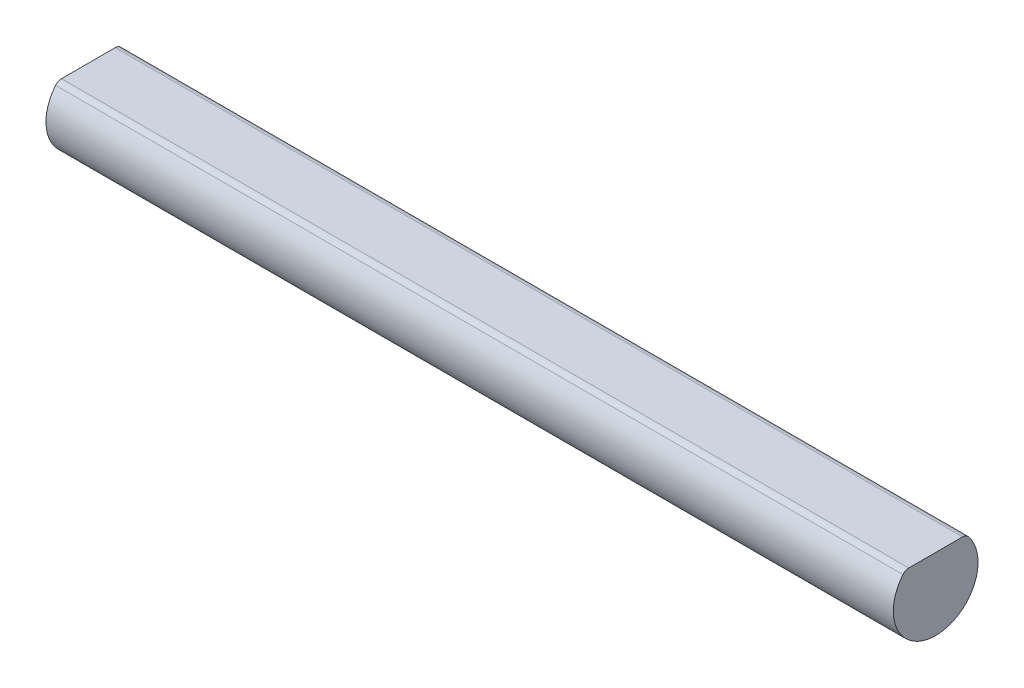
ISO-10303-21;
HEADER;
FILE_DESCRIPTION(('STEP AP214'),'2;1');
FILE_NAME('part.step','',(''),(''),'','','');
FILE_SCHEMA(('AUTOMOTIVE_DESIGN { 1 0 10303 214 1 1 1 1 }'));
ENDSEC;
DATA;
#1=APPLICATION_CONTEXT('core data for automotive mechanical design processes');
#2=APPLICATION_PROTOCOL_DEFINITION('international standard','automotive_design',2000,#1);
#3=PRODUCT_CONTEXT('',#1,'mechanical');
#4=PRODUCT('Part','Part','',(#3));
#5=PRODUCT_RELATED_PRODUCT_CATEGORY('part','',(#4));
#6=PRODUCT_DEFINITION_FORMATION('','',#4);
#7=PRODUCT_DEFINITION_CONTEXT('part definition',#1,'design');
#8=PRODUCT_DEFINITION('design','',#6,#7);
#9=PRODUCT_DEFINITION_SHAPE('','',#8);
#10=(LENGTH_UNIT() NAMED_UNIT(*) SI_UNIT(.MILLI.,.METRE.));
#11=(NAMED_UNIT(*) PLANE_ANGLE_UNIT() SI_UNIT($,.RADIAN.));
#12=(NAMED_UNIT(*) SI_UNIT($,.STERADIAN.) SOLID_ANGLE_UNIT());
#13=UNCERTAINTY_MEASURE_WITH_UNIT(LENGTH_MEASURE(1.E-05),#10,'distance_accuracy_value','');
#14=(GEOMETRIC_REPRESENTATION_CONTEXT(3) GLOBAL_UNCERTAINTY_ASSIGNED_CONTEXT((#13)) GLOBAL_UNIT_ASSIGNED_CONTEXT((#10,
#11,#12)) REPRESENTATION_CONTEXT('',''));
#15=CARTESIAN_POINT('',(0.,0.,0.));
#16=DIRECTION('',(0.,0.,1.));
#17=DIRECTION('',(1.,0.,0.));
#18=AXIS2_PLACEMENT_3D('',#15,#16,#17);
#19=CARTESIAN_POINT('',(100.,0.,0.));
#20=DIRECTION('',(-1.,0.,0.));
#21=DIRECTION('',(0.,0.,1.));
#22=AXIS2_PLACEMENT_3D('',#19,#20,#21);
#23=CYLINDRICAL_SURFACE('',#22,5.);
#24=CARTESIAN_POINT('',(0.,0.,0.));
#25=DIRECTION('',(1.,0.,0.));
#26=DIRECTION('',(0.,0.,-1.));
#27=AXIS2_PLACEMENT_3D('',#24,#25,#26);
#28=CIRCLE('',#27,5.);
#29=CARTESIAN_POINT('',(0.,3.17073170731707,3.86606524003594));
#30=VERTEX_POINT('',#29);
#31=CARTESIAN_POINT('',(0.,3.17073170731707,-3.86606524003594));
#32=VERTEX_POINT('',#31);
#33=EDGE_CURVE('E115',#30,#32,#28,.T.);
#34=ORIENTED_EDGE('',*,*,#33,.T.);
#35=DIRECTION('',(-1.,0.,0.));
#36=VECTOR('',#35,1.);
#37=CARTESIAN_POINT('',(100.,3.17073170731707,-3.86606524003594));
#38=LINE('',#37,#36);
#39=CARTESIAN_POINT('',(100.,3.17073170731707,-3.86606524003594));
#40=VERTEX_POINT('',#39);
#41=EDGE_CURVE('E60',#32,#40,#38,.F.);
#42=ORIENTED_EDGE('',*,*,#41,.T.);
#43=CARTESIAN_POINT('',(100.,0.,0.));
#44=DIRECTION('',(1.,0.,0.));
#45=DIRECTION('',(0.,0.,-1.));
#46=AXIS2_PLACEMENT_3D('',#43,#44,#45);
#47=CIRCLE('',#46,5.);
#48=CARTESIAN_POINT('',(100.,3.17073170731707,3.86606524003594));
#49=VERTEX_POINT('',#48);
#50=EDGE_CURVE('E110',#49,#40,#47,.T.);
#51=ORIENTED_EDGE('',*,*,#50,.F.);
#52=DIRECTION('',(-1.,0.,0.));
#53=VECTOR('',#52,1.);
#54=CARTESIAN_POINT('',(100.,3.17073170731707,3.86606524003594));
#55=LINE('',#54,#53);
#56=EDGE_CURVE('E93',#49,#30,#55,.T.);
#57=ORIENTED_EDGE('',*,*,#56,.T.);
#58=EDGE_LOOP('',(#34,#42,#51,#57));
#59=FACE_BOUND('',#58,.T.);
#60=ADVANCED_FACE('F44',(#59),#23,.T.);
#61=CARTESIAN_POINT('',(100.,0.,0.));
#62=DIRECTION('',(1.,0.,0.));
#63=DIRECTION('',(0.,0.,-1.));
#64=AXIS2_PLACEMENT_3D('',#61,#62,#63);
#65=PLANE('',#64);
#66=ORIENTED_EDGE('',*,*,#50,.T.);
#67=CARTESIAN_POINT('',(100.,2.6,-3.17017349682947));
#68=DIRECTION('',(1.,0.,0.));
#69=DIRECTION('',(0.,0.,-1.));
#70=AXIS2_PLACEMENT_3D('',#67,#68,#69);
#71=CIRCLE('',#70,0.9);
#72=CARTESIAN_POINT('',(100.,3.5,-3.17017349682947));
#73=VERTEX_POINT('',#72);
#74=EDGE_CURVE('E11',#40,#73,#71,.T.);
#75=ORIENTED_EDGE('',*,*,#74,.T.);
#76=DIRECTION('',(0.,0.,1.));
#77=VECTOR('',#76,1.);
#78=CARTESIAN_POINT('',(100.,3.5,0.));
#79=LINE('',#78,#77);
#80=CARTESIAN_POINT('',(100.,3.5,3.17017349682947));
#81=VERTEX_POINT('',#80);
#82=EDGE_CURVE('E103',#73,#81,#79,.T.);
#83=ORIENTED_EDGE('',*,*,#82,.T.);
#84=CARTESIAN_POINT('',(100.,2.6,3.17017349682947));
#85=DIRECTION('',(1.,0.,0.));
#86=DIRECTION('',(0.,0.,-1.));
#87=AXIS2_PLACEMENT_3D('',#84,#85,#86);
#88=CIRCLE('',#87,0.9);
#89=EDGE_CURVE('E53',#81,#49,#88,.T.);
#90=ORIENTED_EDGE('',*,*,#89,.T.);
#91=EDGE_LOOP('',(#66,#75,#83,#90));
#92=FACE_BOUND('',#91,.T.);
#93=ADVANCED_FACE('F128',(#92),#65,.T.);
#94=CARTESIAN_POINT('',(0.,0.,0.));
#95=DIRECTION('',(1.,0.,0.));
#96=DIRECTION('',(0.,0.,-1.));
#97=AXIS2_PLACEMENT_3D('',#94,#95,#96);
#98=PLANE('',#97);
#99=DIRECTION('',(0.,0.,1.));
#100=VECTOR('',#99,1.);
#101=CARTESIAN_POINT('',(0.,3.5,0.));
#102=LINE('',#101,#100);
#103=CARTESIAN_POINT('',(0.,3.5,-3.17017349682947));
#104=VERTEX_POINT('',#103);
#105=CARTESIAN_POINT('',(0.,3.5,3.17017349682947));
#106=VERTEX_POINT('',#105);
#107=EDGE_CURVE('E101',#104,#106,#102,.T.);
#108=ORIENTED_EDGE('',*,*,#107,.F.);
#109=CARTESIAN_POINT('',(0.,2.6,-3.17017349682947));
#110=DIRECTION('',(1.,0.,0.));
#111=DIRECTION('',(0.,0.,-1.));
#112=AXIS2_PLACEMENT_3D('',#109,#110,#111);
#113=CIRCLE('',#112,0.9);
#114=EDGE_CURVE('E84',#104,#32,#113,.F.);
#115=ORIENTED_EDGE('',*,*,#114,.T.);
#116=ORIENTED_EDGE('',*,*,#33,.F.);
#117=CARTESIAN_POINT('',(0.,2.6,3.17017349682947));
#118=DIRECTION('',(1.,0.,0.));
#119=DIRECTION('',(0.,0.,-1.));
#120=AXIS2_PLACEMENT_3D('',#117,#118,#119);
#121=CIRCLE('',#120,0.9);
#122=EDGE_CURVE('E94',#30,#106,#121,.F.);
#123=ORIENTED_EDGE('',*,*,#122,.T.);
#124=EDGE_LOOP('',(#108,#115,#116,#123));
#125=FACE_BOUND('',#124,.T.);
#126=ADVANCED_FACE('F107',(#125),#98,.F.);
#127=CARTESIAN_POINT('',(0.,3.5,0.));
#128=DIRECTION('',(0.,1.,0.));
#129=DIRECTION('',(0.,0.,1.));
#130=AXIS2_PLACEMENT_3D('',#127,#128,#129);
#131=PLANE('',#130);
#132=ORIENTED_EDGE('',*,*,#82,.F.);
#133=DIRECTION('',(1.,0.,0.));
#134=VECTOR('',#133,1.);
#135=CARTESIAN_POINT('',(0.,3.5,-3.17017349682947));
#136=LINE('',#135,#134);
#137=EDGE_CURVE('E88',#73,#104,#136,.F.);
#138=ORIENTED_EDGE('',*,*,#137,.T.);
#139=ORIENTED_EDGE('',*,*,#107,.T.);
#140=DIRECTION('',(1.,0.,0.));
#141=VECTOR('',#140,1.);
#142=CARTESIAN_POINT('',(100.,3.5,3.17017349682947));
#143=LINE('',#142,#141);
#144=EDGE_CURVE('E105',#106,#81,#143,.T.);
#145=ORIENTED_EDGE('',*,*,#144,.T.);
#146=EDGE_LOOP('',(#132,#138,#139,#145));
#147=FACE_BOUND('',#146,.T.);
#148=ADVANCED_FACE('F99',(#147),#131,.T.);
#149=CARTESIAN_POINT('',(100.,2.6,-3.17017349682947));
#150=DIRECTION('',(-1.,0.,0.));
#151=DIRECTION('',(0.,0.,1.));
#152=AXIS2_PLACEMENT_3D('',#149,#150,#151);
#153=CYLINDRICAL_SURFACE('',#152,0.9);
#154=ORIENTED_EDGE('',*,*,#74,.F.);
#155=ORIENTED_EDGE('',*,*,#41,.F.);
#156=ORIENTED_EDGE('',*,*,#114,.F.);
#157=ORIENTED_EDGE('',*,*,#137,.F.);
#158=EDGE_LOOP('',(#154,#155,#156,#157));
#159=FACE_BOUND('',#158,.T.);
#160=ADVANCED_FACE('F87',(#159),#153,.T.);
#161=CARTESIAN_POINT('',(100.,2.6,3.17017349682947));
#162=DIRECTION('',(-1.,0.,0.));
#163=DIRECTION('',(0.,0.,1.));
#164=AXIS2_PLACEMENT_3D('',#161,#162,#163);
#165=CYLINDRICAL_SURFACE('',#164,0.9);
#166=ORIENTED_EDGE('',*,*,#122,.F.);
#167=ORIENTED_EDGE('',*,*,#56,.F.);
#168=ORIENTED_EDGE('',*,*,#89,.F.);
#169=ORIENTED_EDGE('',*,*,#144,.F.);
#170=EDGE_LOOP('',(#166,#167,#168,#169));
#171=FACE_BOUND('',#170,.T.);
#172=ADVANCED_FACE('F46',(#171),#165,.T.);
#173=CLOSED_SHELL('',(#60,#93,#126,#148,#160,#172));
#174=MANIFOLD_SOLID_BREP('B2',#173);
#175=ADVANCED_BREP_SHAPE_REPRESENTATION('',(#18,#174),#14);
#176=SHAPE_DEFINITION_REPRESENTATION(#9,#175);
ENDSEC;
END-ISO-10303-21;
